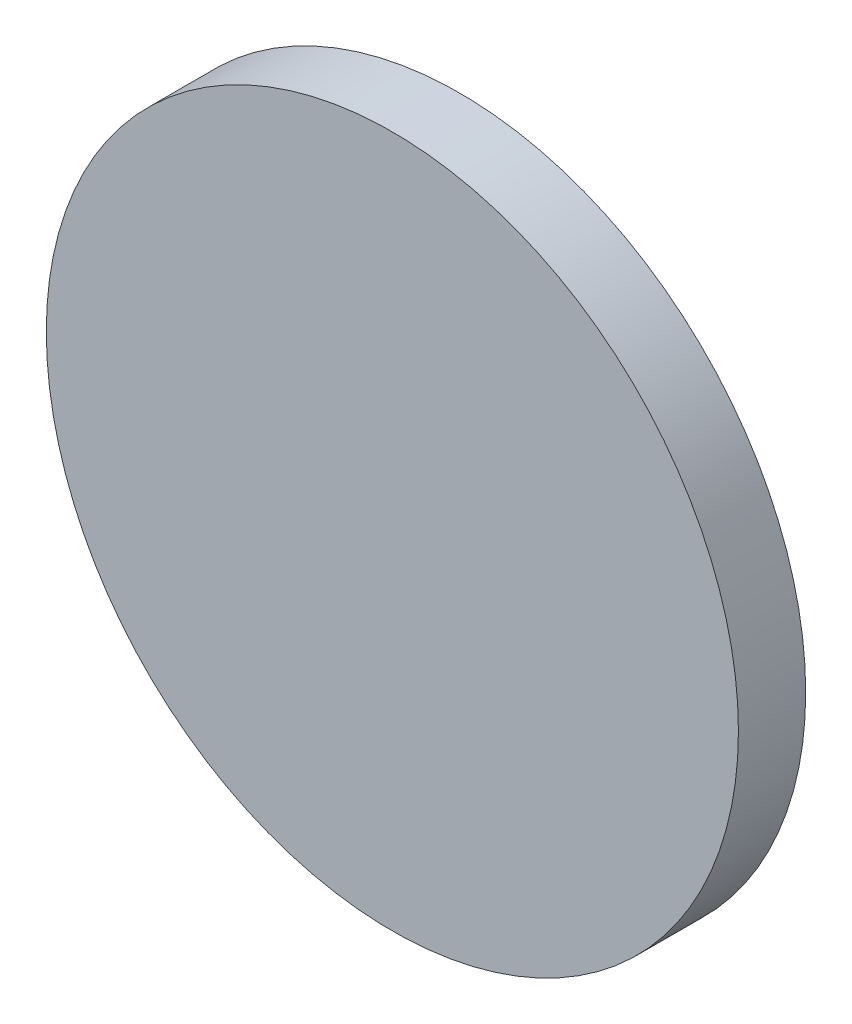
ISO-10303-21;
HEADER;
FILE_DESCRIPTION(('STEP AP214'),'2;1');
FILE_NAME('part.step','',(''),(''),'','','');
FILE_SCHEMA(('AUTOMOTIVE_DESIGN { 1 0 10303 214 1 1 1 1 }'));
ENDSEC;
DATA;
#1=APPLICATION_CONTEXT('core data for automotive mechanical design processes');
#2=APPLICATION_PROTOCOL_DEFINITION('international standard','automotive_design',2000,#1);
#3=PRODUCT_CONTEXT('',#1,'mechanical');
#4=PRODUCT('Part','Part','',(#3));
#5=PRODUCT_RELATED_PRODUCT_CATEGORY('part','',(#4));
#6=PRODUCT_DEFINITION_FORMATION('','',#4);
#7=PRODUCT_DEFINITION_CONTEXT('part definition',#1,'design');
#8=PRODUCT_DEFINITION('design','',#6,#7);
#9=PRODUCT_DEFINITION_SHAPE('','',#8);
#10=(LENGTH_UNIT() NAMED_UNIT(*) SI_UNIT(.MILLI.,.METRE.));
#11=(NAMED_UNIT(*) PLANE_ANGLE_UNIT() SI_UNIT($,.RADIAN.));
#12=(NAMED_UNIT(*) SI_UNIT($,.STERADIAN.) SOLID_ANGLE_UNIT());
#13=UNCERTAINTY_MEASURE_WITH_UNIT(LENGTH_MEASURE(1.E-05),#10,'distance_accuracy_value','');
#14=(GEOMETRIC_REPRESENTATION_CONTEXT(3) GLOBAL_UNCERTAINTY_ASSIGNED_CONTEXT((#13)) GLOBAL_UNIT_ASSIGNED_CONTEXT((#10,
#11,#12)) REPRESENTATION_CONTEXT('',''));
#15=CARTESIAN_POINT('',(0.,0.,0.));
#16=DIRECTION('',(0.,0.,1.));
#17=DIRECTION('',(1.,0.,0.));
#18=AXIS2_PLACEMENT_3D('',#15,#16,#17);
#19=CARTESIAN_POINT('',(2.0031124878754,1.99113616794209,0.8));
#20=DIRECTION('',(0.,0.,1.));
#21=DIRECTION('',(1.,0.,0.));
#22=AXIS2_PLACEMENT_3D('',#19,#20,#21);
#23=PLANE('',#22);
#24=CARTESIAN_POINT('',(2.0031124878754,1.99113616794209,0.8));
#25=DIRECTION('',(0.,0.,-1.));
#26=DIRECTION('',(-1.,0.,0.));
#27=AXIS2_PLACEMENT_3D('',#24,#25,#26);
#28=CIRCLE('',#27,0.257190335341088);
#29=CARTESIAN_POINT('',(1.74592215253431,1.99113616794209,0.8));
#30=VERTEX_POINT('',#29);
#31=EDGE_CURVE('E17',#30,#30,#28,.T.);
#32=ORIENTED_EDGE('',*,*,#31,.F.);
#33=EDGE_LOOP('',(#32));
#34=FACE_BOUND('',#33,.T.);
#35=ADVANCED_FACE('F14',(#34),#23,.T.);
#36=CARTESIAN_POINT('',(2.0031124878754,1.99113616794209,0.8));
#37=DIRECTION('',(0.,0.,-1.));
#38=DIRECTION('',(-1.,0.,0.));
#39=AXIS2_PLACEMENT_3D('',#36,#37,#38);
#40=CYLINDRICAL_SURFACE('',#39,0.257190335341088);
#41=ORIENTED_EDGE('',*,*,#31,.T.);
#42=EDGE_LOOP('',(#41));
#43=FACE_BOUND('',#42,.T.);
#44=CARTESIAN_POINT('',(2.0031124878754,1.99113616794209,0.75));
#45=DIRECTION('',(0.,0.,-1.));
#46=DIRECTION('',(-1.,0.,0.));
#47=AXIS2_PLACEMENT_3D('',#44,#45,#46);
#48=CIRCLE('',#47,0.257190335341088);
#49=CARTESIAN_POINT('',(1.74592215253431,1.99113616794209,0.75));
#50=VERTEX_POINT('',#49);
#51=EDGE_CURVE('E9',#50,#50,#48,.F.);
#52=ORIENTED_EDGE('',*,*,#51,.T.);
#53=EDGE_LOOP('',(#52));
#54=FACE_BOUND('',#53,.T.);
#55=ADVANCED_FACE('F26',(#43,#54),#40,.T.);
#56=CARTESIAN_POINT('',(2.0031124878754,1.99113616794209,0.75));
#57=DIRECTION('',(0.,0.,1.));
#58=DIRECTION('',(1.,0.,0.));
#59=AXIS2_PLACEMENT_3D('',#56,#57,#58);
#60=PLANE('',#59);
#61=ORIENTED_EDGE('',*,*,#51,.F.);
#62=EDGE_LOOP('',(#61));
#63=FACE_BOUND('',#62,.T.);
#64=ADVANCED_FACE('F33',(#63),#60,.F.);
#65=CLOSED_SHELL('',(#35,#55,#64));
#66=MANIFOLD_SOLID_BREP('B1',#65);
#67=ADVANCED_BREP_SHAPE_REPRESENTATION('',(#18,#66),#14);
#68=SHAPE_DEFINITION_REPRESENTATION(#9,#67);
ENDSEC;
END-ISO-10303-21;
